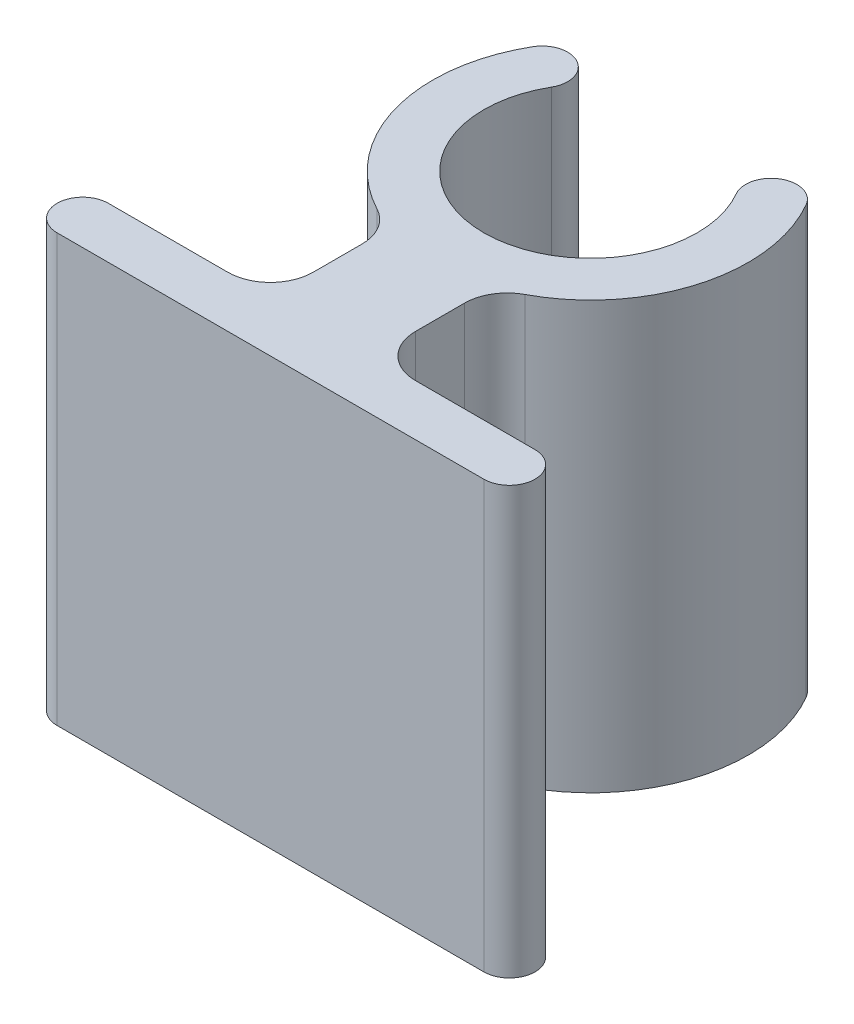
ISO-10303-21;
HEADER;
FILE_DESCRIPTION(('STEP AP214'),'2;1');
FILE_NAME('part.step','',(''),(''),'','','');
FILE_SCHEMA(('AUTOMOTIVE_DESIGN { 1 0 10303 214 1 1 1 1 }'));
ENDSEC;
DATA;
#1=APPLICATION_CONTEXT('core data for automotive mechanical design processes');
#2=APPLICATION_PROTOCOL_DEFINITION('international standard','automotive_design',2000,#1);
#3=PRODUCT_CONTEXT('',#1,'mechanical');
#4=PRODUCT('Part','Part','',(#3));
#5=PRODUCT_RELATED_PRODUCT_CATEGORY('part','',(#4));
#6=PRODUCT_DEFINITION_FORMATION('','',#4);
#7=PRODUCT_DEFINITION_CONTEXT('part definition',#1,'design');
#8=PRODUCT_DEFINITION('design','',#6,#7);
#9=PRODUCT_DEFINITION_SHAPE('','',#8);
#10=(LENGTH_UNIT() NAMED_UNIT(*) SI_UNIT(.MILLI.,.METRE.));
#11=(NAMED_UNIT(*) PLANE_ANGLE_UNIT() SI_UNIT($,.RADIAN.));
#12=(NAMED_UNIT(*) SI_UNIT($,.STERADIAN.) SOLID_ANGLE_UNIT());
#13=UNCERTAINTY_MEASURE_WITH_UNIT(LENGTH_MEASURE(1.E-05),#10,'distance_accuracy_value','');
#14=(GEOMETRIC_REPRESENTATION_CONTEXT(3) GLOBAL_UNCERTAINTY_ASSIGNED_CONTEXT((#13)) GLOBAL_UNIT_ASSIGNED_CONTEXT((#10,
#11,#12)) REPRESENTATION_CONTEXT('',''));
#15=CARTESIAN_POINT('',(0.,0.,0.));
#16=DIRECTION('',(0.,0.,1.));
#17=DIRECTION('',(1.,0.,0.));
#18=AXIS2_PLACEMENT_3D('',#15,#16,#17);
#19=CARTESIAN_POINT('',(0.,10.,0.));
#20=DIRECTION('',(0.,-1.,0.));
#21=DIRECTION('',(0.,0.,-1.));
#22=AXIS2_PLACEMENT_3D('',#19,#20,#21);
#23=CYLINDRICAL_SURFACE('',#22,2.5);
#24=CARTESIAN_POINT('',(0.,0.,0.));
#25=DIRECTION('',(0.,-1.,0.));
#26=DIRECTION('',(0.,0.,1.));
#27=AXIS2_PLACEMENT_3D('',#24,#25,#26);
#28=CIRCLE('',#27,2.5);
#29=CARTESIAN_POINT('',(2.16506350946109,0.,-1.25000000000001));
#30=VERTEX_POINT('',#29);
#31=CARTESIAN_POINT('',(-2.16506350946109,0.,-1.25000000000001));
#32=VERTEX_POINT('',#31);
#33=EDGE_CURVE('E196',#30,#32,#28,.T.);
#34=ORIENTED_EDGE('',*,*,#33,.T.);
#35=DIRECTION('',(0.,-1.,0.));
#36=VECTOR('',#35,1.);
#37=CARTESIAN_POINT('',(-2.16506350946109,10.,-1.25000000000001));
#38=LINE('',#37,#36);
#39=CARTESIAN_POINT('',(-2.16506350946109,10.,-1.25000000000001));
#40=VERTEX_POINT('',#39);
#41=EDGE_CURVE('E152',#40,#32,#38,.T.);
#42=ORIENTED_EDGE('',*,*,#41,.F.);
#43=CARTESIAN_POINT('',(0.,10.,0.));
#44=DIRECTION('',(0.,-1.,0.));
#45=DIRECTION('',(0.,0.,1.));
#46=AXIS2_PLACEMENT_3D('',#43,#44,#45);
#47=CIRCLE('',#46,2.5);
#48=CARTESIAN_POINT('',(2.16506350946109,10.,-1.25000000000001));
#49=VERTEX_POINT('',#48);
#50=EDGE_CURVE('E146',#49,#40,#47,.T.);
#51=ORIENTED_EDGE('',*,*,#50,.F.);
#52=DIRECTION('',(0.,-1.,0.));
#53=VECTOR('',#52,1.);
#54=CARTESIAN_POINT('',(2.16506350946109,10.,-1.25000000000001));
#55=LINE('',#54,#53);
#56=EDGE_CURVE('E150',#49,#30,#55,.T.);
#57=ORIENTED_EDGE('',*,*,#56,.T.);
#58=EDGE_LOOP('',(#34,#42,#51,#57));
#59=FACE_BOUND('',#58,.T.);
#60=ADVANCED_FACE('F32',(#59),#23,.F.);
#61=CARTESIAN_POINT('',(-2.68467875173175,10.,-1.55000000000001));
#62=DIRECTION('',(0.,-1.,0.));
#63=DIRECTION('',(0.,0.,-1.));
#64=AXIS2_PLACEMENT_3D('',#61,#62,#63);
#65=CYLINDRICAL_SURFACE('',#64,0.6);
#66=CARTESIAN_POINT('',(-2.68467875173175,0.,-1.55000000000001));
#67=DIRECTION('',(0.,1.,0.));
#68=DIRECTION('',(0.,0.,1.));
#69=AXIS2_PLACEMENT_3D('',#66,#67,#68);
#70=CIRCLE('',#69,0.6);
#71=CARTESIAN_POINT('',(-3.20429399400241,0.,-1.85000000000002));
#72=VERTEX_POINT('',#71);
#73=EDGE_CURVE('E212',#32,#72,#70,.T.);
#74=ORIENTED_EDGE('',*,*,#73,.T.);
#75=DIRECTION('',(0.,-1.,0.));
#76=VECTOR('',#75,1.);
#77=CARTESIAN_POINT('',(-3.20429399400241,10.,-1.85000000000002));
#78=LINE('',#77,#76);
#79=CARTESIAN_POINT('',(-3.20429399400241,10.,-1.85000000000002));
#80=VERTEX_POINT('',#79);
#81=EDGE_CURVE('E229',#80,#72,#78,.T.);
#82=ORIENTED_EDGE('',*,*,#81,.F.);
#83=CARTESIAN_POINT('',(-2.68467875173175,10.,-1.55000000000001));
#84=DIRECTION('',(0.,1.,0.));
#85=DIRECTION('',(0.,0.,1.));
#86=AXIS2_PLACEMENT_3D('',#83,#84,#85);
#87=CIRCLE('',#86,0.6);
#88=EDGE_CURVE('E154',#40,#80,#87,.T.);
#89=ORIENTED_EDGE('',*,*,#88,.F.);
#90=ORIENTED_EDGE('',*,*,#41,.T.);
#91=EDGE_LOOP('',(#74,#82,#89,#90));
#92=FACE_BOUND('',#91,.T.);
#93=ADVANCED_FACE('F267',(#92),#65,.T.);
#94=CARTESIAN_POINT('',(0.,10.,0.));
#95=DIRECTION('',(0.,-1.,0.));
#96=DIRECTION('',(0.,0.,-1.));
#97=AXIS2_PLACEMENT_3D('',#94,#95,#96);
#98=CYLINDRICAL_SURFACE('',#97,3.7);
#99=CARTESIAN_POINT('',(0.,0.,0.));
#100=DIRECTION('',(0.,1.,0.));
#101=DIRECTION('',(0.,0.,1.));
#102=AXIS2_PLACEMENT_3D('',#99,#100,#101);
#103=CIRCLE('',#102,3.7);
#104=CARTESIAN_POINT('',(-1.73191489361702,0.,3.2696285417869));
#105=VERTEX_POINT('',#104);
#106=EDGE_CURVE('E214',#72,#105,#103,.T.);
#107=ORIENTED_EDGE('',*,*,#106,.T.);
#108=DIRECTION('',(0.,-1.,0.));
#109=VECTOR('',#108,1.);
#110=CARTESIAN_POINT('',(-1.73191489361702,10.,3.2696285417869));
#111=LINE('',#110,#109);
#112=CARTESIAN_POINT('',(-1.73191489361702,10.,3.2696285417869));
#113=VERTEX_POINT('',#112);
#114=EDGE_CURVE('E47',#105,#113,#111,.F.);
#115=ORIENTED_EDGE('',*,*,#114,.T.);
#116=CARTESIAN_POINT('',(0.,10.,0.));
#117=DIRECTION('',(0.,1.,0.));
#118=DIRECTION('',(0.,0.,1.));
#119=AXIS2_PLACEMENT_3D('',#116,#117,#118);
#120=CIRCLE('',#119,3.7);
#121=EDGE_CURVE('E199',#80,#113,#120,.T.);
#122=ORIENTED_EDGE('',*,*,#121,.F.);
#123=ORIENTED_EDGE('',*,*,#81,.T.);
#124=EDGE_LOOP('',(#107,#115,#122,#123));
#125=FACE_BOUND('',#124,.T.);
#126=ADVANCED_FACE('F265',(#125),#98,.T.);
#127=CARTESIAN_POINT('',(-1.2,10.,3.5));
#128=DIRECTION('',(1.,0.,0.));
#129=DIRECTION('',(0.,0.,-1.));
#130=AXIS2_PLACEMENT_3D('',#127,#128,#129);
#131=PLANE('',#130);
#132=DIRECTION('',(0.,0.,1.));
#133=VECTOR('',#132,1.);
#134=CARTESIAN_POINT('',(-1.2,0.,3.5));
#135=LINE('',#134,#133);
#136=CARTESIAN_POINT('',(-1.2,0.,4.15331193145904));
#137=VERTEX_POINT('',#136);
#138=CARTESIAN_POINT('',(-1.2,0.,5.3));
#139=VERTEX_POINT('',#138);
#140=EDGE_CURVE('E216',#137,#139,#135,.T.);
#141=ORIENTED_EDGE('',*,*,#140,.T.);
#142=DIRECTION('',(0.,-1.,0.));
#143=VECTOR('',#142,1.);
#144=CARTESIAN_POINT('',(-1.2,10.,5.3));
#145=LINE('',#144,#143);
#146=CARTESIAN_POINT('',(-1.2,10.,5.3));
#147=VERTEX_POINT('',#146);
#148=EDGE_CURVE('E239',#139,#147,#145,.F.);
#149=ORIENTED_EDGE('',*,*,#148,.T.);
#150=DIRECTION('',(0.,0.,1.));
#151=VECTOR('',#150,1.);
#152=CARTESIAN_POINT('',(-1.2,10.,3.5));
#153=LINE('',#152,#151);
#154=CARTESIAN_POINT('',(-1.2,10.,4.15331193145904));
#155=VERTEX_POINT('',#154);
#156=EDGE_CURVE('E201',#155,#147,#153,.T.);
#157=ORIENTED_EDGE('',*,*,#156,.F.);
#158=DIRECTION('',(0.,1.,0.));
#159=VECTOR('',#158,1.);
#160=CARTESIAN_POINT('',(-1.2,0.,4.15331193145904));
#161=LINE('',#160,#159);
#162=EDGE_CURVE('E236',#155,#137,#161,.F.);
#163=ORIENTED_EDGE('',*,*,#162,.T.);
#164=EDGE_LOOP('',(#141,#149,#157,#163));
#165=FACE_BOUND('',#164,.T.);
#166=ADVANCED_FACE('F260',(#165),#131,.F.);
#167=CARTESIAN_POINT('',(-1.2,10.,6.3));
#168=DIRECTION('',(0.,0.,1.));
#169=DIRECTION('',(1.,0.,0.));
#170=AXIS2_PLACEMENT_3D('',#167,#168,#169);
#171=PLANE('',#170);
#172=DIRECTION('',(-1.,0.,0.));
#173=VECTOR('',#172,1.);
#174=CARTESIAN_POINT('',(-1.2,10.,6.3));
#175=LINE('',#174,#173);
#176=CARTESIAN_POINT('',(-2.2,10.,6.3));
#177=VERTEX_POINT('',#176);
#178=CARTESIAN_POINT('',(-5.,10.,6.3));
#179=VERTEX_POINT('',#178);
#180=EDGE_CURVE('E204',#177,#179,#175,.T.);
#181=ORIENTED_EDGE('',*,*,#180,.F.);
#182=DIRECTION('',(0.,-1.,0.));
#183=VECTOR('',#182,1.);
#184=CARTESIAN_POINT('',(-2.2,0.,6.3));
#185=LINE('',#184,#183);
#186=CARTESIAN_POINT('',(-2.2,0.,6.3));
#187=VERTEX_POINT('',#186);
#188=EDGE_CURVE('E233',#177,#187,#185,.T.);
#189=ORIENTED_EDGE('',*,*,#188,.T.);
#190=DIRECTION('',(-1.,0.,0.));
#191=VECTOR('',#190,1.);
#192=CARTESIAN_POINT('',(-1.2,0.,6.3));
#193=LINE('',#192,#191);
#194=CARTESIAN_POINT('',(-5.,0.,6.3));
#195=VERTEX_POINT('',#194);
#196=EDGE_CURVE('E219',#187,#195,#193,.T.);
#197=ORIENTED_EDGE('',*,*,#196,.T.);
#198=DIRECTION('',(0.,-1.,0.));
#199=VECTOR('',#198,1.);
#200=CARTESIAN_POINT('',(-5.,10.,6.3));
#201=LINE('',#200,#199);
#202=EDGE_CURVE('E226',#179,#195,#201,.T.);
#203=ORIENTED_EDGE('',*,*,#202,.F.);
#204=EDGE_LOOP('',(#181,#189,#197,#203));
#205=FACE_BOUND('',#204,.T.);
#206=ADVANCED_FACE('F253',(#205),#171,.F.);
#207=CARTESIAN_POINT('',(-5.,10.,6.9));
#208=DIRECTION('',(0.,-1.,0.));
#209=DIRECTION('',(0.,0.,-1.));
#210=AXIS2_PLACEMENT_3D('',#207,#208,#209);
#211=CYLINDRICAL_SURFACE('',#210,0.6);
#212=CARTESIAN_POINT('',(-5.,0.,6.9));
#213=DIRECTION('',(0.,1.,0.));
#214=DIRECTION('',(0.,0.,-1.));
#215=AXIS2_PLACEMENT_3D('',#212,#213,#214);
#216=CIRCLE('',#215,0.6);
#217=CARTESIAN_POINT('',(-5.,0.,7.5));
#218=VERTEX_POINT('',#217);
#219=EDGE_CURVE('E221',#195,#218,#216,.T.);
#220=ORIENTED_EDGE('',*,*,#219,.T.);
#221=DIRECTION('',(0.,-1.,0.));
#222=VECTOR('',#221,1.);
#223=CARTESIAN_POINT('',(-5.,10.,7.5));
#224=LINE('',#223,#222);
#225=CARTESIAN_POINT('',(-5.,10.,7.5));
#226=VERTEX_POINT('',#225);
#227=EDGE_CURVE('E210',#226,#218,#224,.T.);
#228=ORIENTED_EDGE('',*,*,#227,.F.);
#229=CARTESIAN_POINT('',(-5.,10.,6.9));
#230=DIRECTION('',(0.,1.,0.));
#231=DIRECTION('',(0.,0.,-1.));
#232=AXIS2_PLACEMENT_3D('',#229,#230,#231);
#233=CIRCLE('',#232,0.6);
#234=EDGE_CURVE('E206',#179,#226,#233,.T.);
#235=ORIENTED_EDGE('',*,*,#234,.F.);
#236=ORIENTED_EDGE('',*,*,#202,.T.);
#237=EDGE_LOOP('',(#220,#228,#235,#236));
#238=FACE_BOUND('',#237,.T.);
#239=ADVANCED_FACE('F292',(#238),#211,.T.);
#240=CARTESIAN_POINT('',(0.,10.,7.5));
#241=DIRECTION('',(0.,0.,-1.));
#242=DIRECTION('',(-1.,0.,0.));
#243=AXIS2_PLACEMENT_3D('',#240,#241,#242);
#244=PLANE('',#243);
#245=DIRECTION('',(1.,0.,0.));
#246=VECTOR('',#245,1.);
#247=CARTESIAN_POINT('',(0.,0.,7.5));
#248=LINE('',#247,#246);
#249=CARTESIAN_POINT('',(5.,0.,7.5));
#250=VERTEX_POINT('',#249);
#251=EDGE_CURVE('E155',#218,#250,#248,.T.);
#252=ORIENTED_EDGE('',*,*,#251,.T.);
#253=DIRECTION('',(0.,-1.,0.));
#254=VECTOR('',#253,1.);
#255=CARTESIAN_POINT('',(5.,10.,7.5));
#256=LINE('',#255,#254);
#257=CARTESIAN_POINT('',(5.,10.,7.5));
#258=VERTEX_POINT('',#257);
#259=EDGE_CURVE('E424',#258,#250,#256,.T.);
#260=ORIENTED_EDGE('',*,*,#259,.F.);
#261=DIRECTION('',(1.,0.,0.));
#262=VECTOR('',#261,1.);
#263=CARTESIAN_POINT('',(0.,10.,7.5));
#264=LINE('',#263,#262);
#265=EDGE_CURVE('E208',#226,#258,#264,.T.);
#266=ORIENTED_EDGE('',*,*,#265,.F.);
#267=ORIENTED_EDGE('',*,*,#227,.T.);
#268=EDGE_LOOP('',(#252,#260,#266,#267));
#269=FACE_BOUND('',#268,.T.);
#270=ADVANCED_FACE('F286',(#269),#244,.F.);
#271=CARTESIAN_POINT('',(0.,10.,0.));
#272=DIRECTION('',(0.,1.,0.));
#273=DIRECTION('',(0.,0.,1.));
#274=AXIS2_PLACEMENT_3D('',#271,#272,#273);
#275=PLANE('',#274);
#276=ORIENTED_EDGE('',*,*,#50,.T.);
#277=ORIENTED_EDGE('',*,*,#88,.T.);
#278=ORIENTED_EDGE('',*,*,#121,.T.);
#279=CARTESIAN_POINT('',(-2.2,10.,4.15331193145904));
#280=DIRECTION('',(0.,1.,0.));
#281=DIRECTION('',(0.,0.,1.));
#282=AXIS2_PLACEMENT_3D('',#279,#280,#281);
#283=CIRCLE('',#282,1.);
#284=EDGE_CURVE('E11',#113,#155,#283,.F.);
#285=ORIENTED_EDGE('',*,*,#284,.T.);
#286=ORIENTED_EDGE('',*,*,#156,.T.);
#287=CARTESIAN_POINT('',(-2.2,10.,5.3));
#288=DIRECTION('',(0.,1.,0.));
#289=DIRECTION('',(0.,0.,1.));
#290=AXIS2_PLACEMENT_3D('',#287,#288,#289);
#291=CIRCLE('',#290,1.);
#292=EDGE_CURVE('E244',#147,#177,#291,.F.);
#293=ORIENTED_EDGE('',*,*,#292,.T.);
#294=ORIENTED_EDGE('',*,*,#180,.T.);
#295=ORIENTED_EDGE('',*,*,#234,.T.);
#296=ORIENTED_EDGE('',*,*,#265,.T.);
#297=CARTESIAN_POINT('',(5.,10.,6.9));
#298=DIRECTION('',(0.,-1.,0.));
#299=DIRECTION('',(0.,0.,-1.));
#300=AXIS2_PLACEMENT_3D('',#297,#298,#299);
#301=CIRCLE('',#300,0.6);
#302=CARTESIAN_POINT('',(5.,10.,6.3));
#303=VERTEX_POINT('',#302);
#304=EDGE_CURVE('E426',#303,#258,#301,.T.);
#305=ORIENTED_EDGE('',*,*,#304,.F.);
#306=DIRECTION('',(1.,0.,0.));
#307=VECTOR('',#306,1.);
#308=CARTESIAN_POINT('',(1.2,10.,6.3));
#309=LINE('',#308,#307);
#310=CARTESIAN_POINT('',(2.2,10.,6.3));
#311=VERTEX_POINT('',#310);
#312=EDGE_CURVE('E409',#311,#303,#309,.T.);
#313=ORIENTED_EDGE('',*,*,#312,.F.);
#314=CARTESIAN_POINT('',(2.2,10.,5.3));
#315=DIRECTION('',(0.,-1.,0.));
#316=DIRECTION('',(0.,0.,1.));
#317=AXIS2_PLACEMENT_3D('',#314,#315,#316);
#318=CIRCLE('',#317,1.);
#319=CARTESIAN_POINT('',(1.2,10.,5.3));
#320=VERTEX_POINT('',#319);
#321=EDGE_CURVE('E191',#320,#311,#318,.F.);
#322=ORIENTED_EDGE('',*,*,#321,.F.);
#323=DIRECTION('',(0.,0.,1.));
#324=VECTOR('',#323,1.);
#325=CARTESIAN_POINT('',(1.2,10.,3.5));
#326=LINE('',#325,#324);
#327=CARTESIAN_POINT('',(1.2,10.,4.15331193145904));
#328=VERTEX_POINT('',#327);
#329=EDGE_CURVE('E406',#328,#320,#326,.T.);
#330=ORIENTED_EDGE('',*,*,#329,.F.);
#331=CARTESIAN_POINT('',(2.2,10.,4.15331193145904));
#332=DIRECTION('',(0.,-1.,0.));
#333=DIRECTION('',(0.,0.,1.));
#334=AXIS2_PLACEMENT_3D('',#331,#332,#333);
#335=CIRCLE('',#334,1.);
#336=CARTESIAN_POINT('',(1.73191489361702,10.,3.2696285417869));
#337=VERTEX_POINT('',#336);
#338=EDGE_CURVE('E195',#337,#328,#335,.F.);
#339=ORIENTED_EDGE('',*,*,#338,.F.);
#340=CARTESIAN_POINT('',(0.,10.,0.));
#341=DIRECTION('',(0.,-1.,0.));
#342=DIRECTION('',(0.,0.,1.));
#343=AXIS2_PLACEMENT_3D('',#340,#341,#342);
#344=CIRCLE('',#343,3.7);
#345=CARTESIAN_POINT('',(3.20429399400241,10.,-1.85000000000002));
#346=VERTEX_POINT('',#345);
#347=EDGE_CURVE('E161',#346,#337,#344,.T.);
#348=ORIENTED_EDGE('',*,*,#347,.F.);
#349=CARTESIAN_POINT('',(2.68467875173175,10.,-1.55000000000001));
#350=DIRECTION('',(0.,-1.,0.));
#351=DIRECTION('',(0.,0.,1.));
#352=AXIS2_PLACEMENT_3D('',#349,#350,#351);
#353=CIRCLE('',#352,0.6);
#354=EDGE_CURVE('E158',#49,#346,#353,.T.);
#355=ORIENTED_EDGE('',*,*,#354,.F.);
#356=EDGE_LOOP('',(#276,#277,#278,#285,#286,#293,#294,#295,#296,#305,#313,#322,#330,#339,#348,#355));
#357=FACE_BOUND('',#356,.T.);
#358=ADVANCED_FACE('F159',(#357),#275,.T.);
#359=CARTESIAN_POINT('',(0.,0.,0.));
#360=DIRECTION('',(0.,1.,0.));
#361=DIRECTION('',(0.,0.,1.));
#362=AXIS2_PLACEMENT_3D('',#359,#360,#361);
#363=PLANE('',#362);
#364=ORIENTED_EDGE('',*,*,#33,.F.);
#365=CARTESIAN_POINT('',(2.68467875173175,0.,-1.55000000000001));
#366=DIRECTION('',(0.,-1.,0.));
#367=DIRECTION('',(0.,0.,1.));
#368=AXIS2_PLACEMENT_3D('',#365,#366,#367);
#369=CIRCLE('',#368,0.6);
#370=CARTESIAN_POINT('',(3.20429399400241,0.,-1.85000000000002));
#371=VERTEX_POINT('',#370);
#372=EDGE_CURVE('E170',#30,#371,#369,.T.);
#373=ORIENTED_EDGE('',*,*,#372,.T.);
#374=CARTESIAN_POINT('',(0.,0.,0.));
#375=DIRECTION('',(0.,-1.,0.));
#376=DIRECTION('',(0.,0.,1.));
#377=AXIS2_PLACEMENT_3D('',#374,#375,#376);
#378=CIRCLE('',#377,3.7);
#379=CARTESIAN_POINT('',(1.73191489361702,0.,3.2696285417869));
#380=VERTEX_POINT('',#379);
#381=EDGE_CURVE('E414',#371,#380,#378,.T.);
#382=ORIENTED_EDGE('',*,*,#381,.T.);
#383=CARTESIAN_POINT('',(2.2,0.,4.15331193145904));
#384=DIRECTION('',(0.,-1.,0.));
#385=DIRECTION('',(0.,0.,1.));
#386=AXIS2_PLACEMENT_3D('',#383,#384,#385);
#387=CIRCLE('',#386,1.);
#388=CARTESIAN_POINT('',(1.2,0.,4.15331193145904));
#389=VERTEX_POINT('',#388);
#390=EDGE_CURVE('E193',#389,#380,#387,.T.);
#391=ORIENTED_EDGE('',*,*,#390,.F.);
#392=DIRECTION('',(0.,0.,1.));
#393=VECTOR('',#392,1.);
#394=CARTESIAN_POINT('',(1.2,0.,3.5));
#395=LINE('',#394,#393);
#396=CARTESIAN_POINT('',(1.2,0.,5.3));
#397=VERTEX_POINT('',#396);
#398=EDGE_CURVE('E412',#389,#397,#395,.T.);
#399=ORIENTED_EDGE('',*,*,#398,.T.);
#400=CARTESIAN_POINT('',(2.2,0.,5.3));
#401=DIRECTION('',(0.,-1.,0.));
#402=DIRECTION('',(0.,0.,1.));
#403=AXIS2_PLACEMENT_3D('',#400,#401,#402);
#404=CIRCLE('',#403,1.);
#405=CARTESIAN_POINT('',(2.2,0.,6.3));
#406=VERTEX_POINT('',#405);
#407=EDGE_CURVE('E189',#406,#397,#404,.T.);
#408=ORIENTED_EDGE('',*,*,#407,.F.);
#409=DIRECTION('',(1.,0.,0.));
#410=VECTOR('',#409,1.);
#411=CARTESIAN_POINT('',(1.2,0.,6.3));
#412=LINE('',#411,#410);
#413=CARTESIAN_POINT('',(5.,0.,6.3));
#414=VERTEX_POINT('',#413);
#415=EDGE_CURVE('E413',#406,#414,#412,.T.);
#416=ORIENTED_EDGE('',*,*,#415,.T.);
#417=CARTESIAN_POINT('',(5.,0.,6.9));
#418=DIRECTION('',(0.,-1.,0.));
#419=DIRECTION('',(0.,0.,-1.));
#420=AXIS2_PLACEMENT_3D('',#417,#418,#419);
#421=CIRCLE('',#420,0.6);
#422=EDGE_CURVE('E165',#414,#250,#421,.T.);
#423=ORIENTED_EDGE('',*,*,#422,.T.);
#424=ORIENTED_EDGE('',*,*,#251,.F.);
#425=ORIENTED_EDGE('',*,*,#219,.F.);
#426=ORIENTED_EDGE('',*,*,#196,.F.);
#427=CARTESIAN_POINT('',(-2.2,0.,5.3));
#428=DIRECTION('',(0.,1.,0.));
#429=DIRECTION('',(0.,0.,1.));
#430=AXIS2_PLACEMENT_3D('',#427,#428,#429);
#431=CIRCLE('',#430,1.);
#432=EDGE_CURVE('E242',#187,#139,#431,.T.);
#433=ORIENTED_EDGE('',*,*,#432,.T.);
#434=ORIENTED_EDGE('',*,*,#140,.F.);
#435=CARTESIAN_POINT('',(-2.2,0.,4.15331193145904));
#436=DIRECTION('',(0.,1.,0.));
#437=DIRECTION('',(0.,0.,1.));
#438=AXIS2_PLACEMENT_3D('',#435,#436,#437);
#439=CIRCLE('',#438,1.);
#440=EDGE_CURVE('E40',#137,#105,#439,.T.);
#441=ORIENTED_EDGE('',*,*,#440,.T.);
#442=ORIENTED_EDGE('',*,*,#106,.F.);
#443=ORIENTED_EDGE('',*,*,#73,.F.);
#444=EDGE_LOOP('',(#364,#373,#382,#391,#399,#408,#416,#423,#424,#425,#426,#433,#434,#441,#442,#443));
#445=FACE_BOUND('',#444,.T.);
#446=ADVANCED_FACE('F257',(#445),#363,.F.);
#447=CARTESIAN_POINT('',(-2.2,10.,5.3));
#448=DIRECTION('',(0.,1.,0.));
#449=DIRECTION('',(0.,0.,1.));
#450=AXIS2_PLACEMENT_3D('',#447,#448,#449);
#451=CYLINDRICAL_SURFACE('',#450,1.);
#452=ORIENTED_EDGE('',*,*,#292,.F.);
#453=ORIENTED_EDGE('',*,*,#148,.F.);
#454=ORIENTED_EDGE('',*,*,#432,.F.);
#455=ORIENTED_EDGE('',*,*,#188,.F.);
#456=EDGE_LOOP('',(#452,#453,#454,#455));
#457=FACE_BOUND('',#456,.T.);
#458=ADVANCED_FACE('F256',(#457),#451,.F.);
#459=CARTESIAN_POINT('',(-2.2,10.,4.15331193145904));
#460=DIRECTION('',(0.,-1.,0.));
#461=DIRECTION('',(0.,0.,-1.));
#462=AXIS2_PLACEMENT_3D('',#459,#460,#461);
#463=CYLINDRICAL_SURFACE('',#462,1.);
#464=ORIENTED_EDGE('',*,*,#284,.F.);
#465=ORIENTED_EDGE('',*,*,#114,.F.);
#466=ORIENTED_EDGE('',*,*,#440,.F.);
#467=ORIENTED_EDGE('',*,*,#162,.F.);
#468=EDGE_LOOP('',(#464,#465,#466,#467));
#469=FACE_BOUND('',#468,.T.);
#470=ADVANCED_FACE('F34',(#469),#463,.F.);
#471=CARTESIAN_POINT('',(2.68467875173175,10.,-1.55000000000001));
#472=DIRECTION('',(0.,-1.,0.));
#473=DIRECTION('',(0.,0.,-1.));
#474=AXIS2_PLACEMENT_3D('',#471,#472,#473);
#475=CYLINDRICAL_SURFACE('',#474,0.6);
#476=ORIENTED_EDGE('',*,*,#372,.F.);
#477=ORIENTED_EDGE('',*,*,#56,.F.);
#478=ORIENTED_EDGE('',*,*,#354,.T.);
#479=DIRECTION('',(0.,-1.,0.));
#480=VECTOR('',#479,1.);
#481=CARTESIAN_POINT('',(3.20429399400241,10.,-1.85000000000002));
#482=LINE('',#481,#480);
#483=EDGE_CURVE('E172',#346,#371,#482,.T.);
#484=ORIENTED_EDGE('',*,*,#483,.T.);
#485=EDGE_LOOP('',(#476,#477,#478,#484));
#486=FACE_BOUND('',#485,.T.);
#487=ADVANCED_FACE('F168',(#486),#475,.T.);
#488=CARTESIAN_POINT('',(0.,10.,0.));
#489=DIRECTION('',(0.,-1.,0.));
#490=DIRECTION('',(0.,0.,-1.));
#491=AXIS2_PLACEMENT_3D('',#488,#489,#490);
#492=CYLINDRICAL_SURFACE('',#491,3.7);
#493=ORIENTED_EDGE('',*,*,#381,.F.);
#494=ORIENTED_EDGE('',*,*,#483,.F.);
#495=ORIENTED_EDGE('',*,*,#347,.T.);
#496=DIRECTION('',(0.,-1.,0.));
#497=VECTOR('',#496,1.);
#498=CARTESIAN_POINT('',(1.73191489361702,10.,3.2696285417869));
#499=LINE('',#498,#497);
#500=EDGE_CURVE('E186',#380,#337,#499,.F.);
#501=ORIENTED_EDGE('',*,*,#500,.F.);
#502=EDGE_LOOP('',(#493,#494,#495,#501));
#503=FACE_BOUND('',#502,.T.);
#504=ADVANCED_FACE('F339',(#503),#492,.T.);
#505=CARTESIAN_POINT('',(1.2,10.,3.5));
#506=DIRECTION('',(-1.,0.,0.));
#507=DIRECTION('',(0.,0.,-1.));
#508=AXIS2_PLACEMENT_3D('',#505,#506,#507);
#509=PLANE('',#508);
#510=ORIENTED_EDGE('',*,*,#398,.F.);
#511=DIRECTION('',(0.,1.,0.));
#512=VECTOR('',#511,1.);
#513=CARTESIAN_POINT('',(1.2,0.,4.15331193145904));
#514=LINE('',#513,#512);
#515=EDGE_CURVE('E175',#328,#389,#514,.F.);
#516=ORIENTED_EDGE('',*,*,#515,.F.);
#517=ORIENTED_EDGE('',*,*,#329,.T.);
#518=DIRECTION('',(0.,-1.,0.));
#519=VECTOR('',#518,1.);
#520=CARTESIAN_POINT('',(1.2,10.,5.3));
#521=LINE('',#520,#519);
#522=EDGE_CURVE('E183',#397,#320,#521,.F.);
#523=ORIENTED_EDGE('',*,*,#522,.F.);
#524=EDGE_LOOP('',(#510,#516,#517,#523));
#525=FACE_BOUND('',#524,.T.);
#526=ADVANCED_FACE('F348',(#525),#509,.F.);
#527=CARTESIAN_POINT('',(1.2,10.,6.3));
#528=DIRECTION('',(0.,0.,1.));
#529=DIRECTION('',(-1.,0.,0.));
#530=AXIS2_PLACEMENT_3D('',#527,#528,#529);
#531=PLANE('',#530);
#532=ORIENTED_EDGE('',*,*,#312,.T.);
#533=DIRECTION('',(0.,-1.,0.));
#534=VECTOR('',#533,1.);
#535=CARTESIAN_POINT('',(5.,10.,6.3));
#536=LINE('',#535,#534);
#537=EDGE_CURVE('E177',#303,#414,#536,.T.);
#538=ORIENTED_EDGE('',*,*,#537,.T.);
#539=ORIENTED_EDGE('',*,*,#415,.F.);
#540=DIRECTION('',(0.,-1.,0.));
#541=VECTOR('',#540,1.);
#542=CARTESIAN_POINT('',(2.2,0.,6.3));
#543=LINE('',#542,#541);
#544=EDGE_CURVE('E171',#311,#406,#543,.T.);
#545=ORIENTED_EDGE('',*,*,#544,.F.);
#546=EDGE_LOOP('',(#532,#538,#539,#545));
#547=FACE_BOUND('',#546,.T.);
#548=ADVANCED_FACE('F358',(#547),#531,.F.);
#549=CARTESIAN_POINT('',(5.,10.,6.9));
#550=DIRECTION('',(0.,-1.,0.));
#551=DIRECTION('',(0.,0.,-1.));
#552=AXIS2_PLACEMENT_3D('',#549,#550,#551);
#553=CYLINDRICAL_SURFACE('',#552,0.6);
#554=ORIENTED_EDGE('',*,*,#422,.F.);
#555=ORIENTED_EDGE('',*,*,#537,.F.);
#556=ORIENTED_EDGE('',*,*,#304,.T.);
#557=ORIENTED_EDGE('',*,*,#259,.T.);
#558=EDGE_LOOP('',(#554,#555,#556,#557));
#559=FACE_BOUND('',#558,.T.);
#560=ADVANCED_FACE('F368',(#559),#553,.T.);
#561=CARTESIAN_POINT('',(2.2,10.,5.3));
#562=DIRECTION('',(0.,1.,0.));
#563=DIRECTION('',(0.,0.,1.));
#564=AXIS2_PLACEMENT_3D('',#561,#562,#563);
#565=CYLINDRICAL_SURFACE('',#564,1.);
#566=ORIENTED_EDGE('',*,*,#321,.T.);
#567=ORIENTED_EDGE('',*,*,#544,.T.);
#568=ORIENTED_EDGE('',*,*,#407,.T.);
#569=ORIENTED_EDGE('',*,*,#522,.T.);
#570=EDGE_LOOP('',(#566,#567,#568,#569));
#571=FACE_BOUND('',#570,.T.);
#572=ADVANCED_FACE('F378',(#571),#565,.F.);
#573=CARTESIAN_POINT('',(2.2,10.,4.15331193145904));
#574=DIRECTION('',(0.,-1.,0.));
#575=DIRECTION('',(0.,0.,-1.));
#576=AXIS2_PLACEMENT_3D('',#573,#574,#575);
#577=CYLINDRICAL_SURFACE('',#576,1.);
#578=ORIENTED_EDGE('',*,*,#338,.T.);
#579=ORIENTED_EDGE('',*,*,#515,.T.);
#580=ORIENTED_EDGE('',*,*,#390,.T.);
#581=ORIENTED_EDGE('',*,*,#500,.T.);
#582=EDGE_LOOP('',(#578,#579,#580,#581));
#583=FACE_BOUND('',#582,.T.);
#584=ADVANCED_FACE('F388',(#583),#577,.F.);
#585=CLOSED_SHELL('',(#60,#93,#126,#166,#206,#239,#270,#358,#446,#458,#470,#487,#504,#526,#548,
#560,#572,#584));
#586=MANIFOLD_SOLID_BREP('B2',#585);
#587=ADVANCED_BREP_SHAPE_REPRESENTATION('',(#18,#586),#14);
#588=SHAPE_DEFINITION_REPRESENTATION(#9,#587);
ENDSEC;
END-ISO-10303-21;
